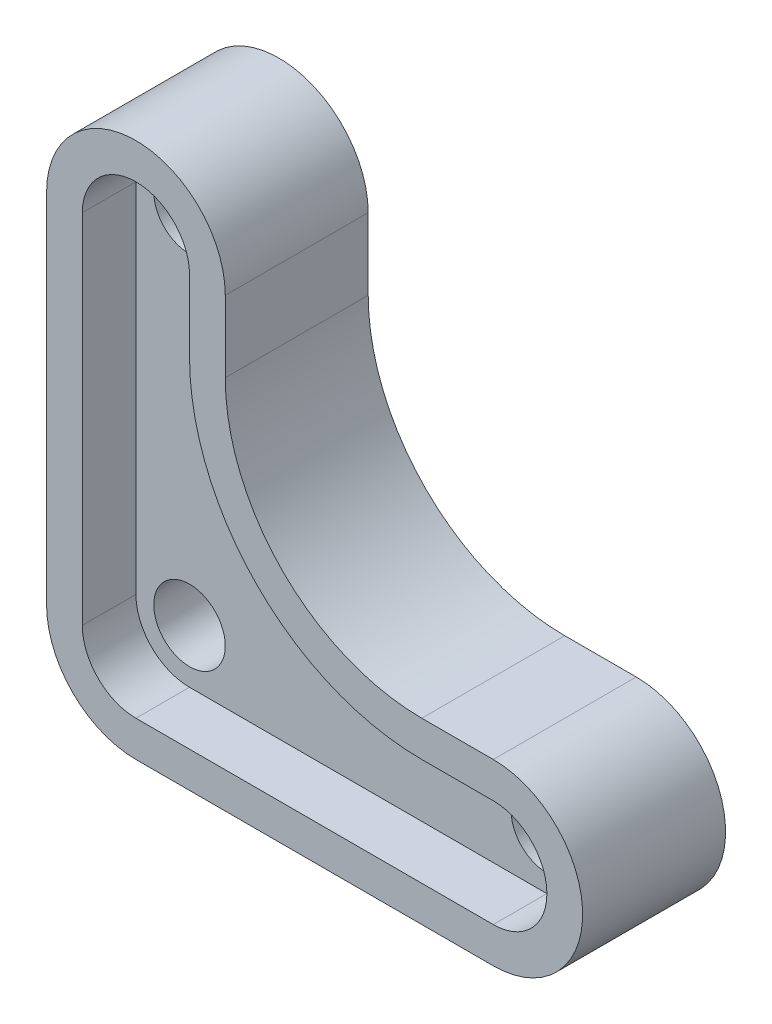
ISO-10303-21;
HEADER;
FILE_DESCRIPTION(('STEP AP214'),'2;1');
FILE_NAME('part.step','',(''),(''),'','','');
FILE_SCHEMA(('AUTOMOTIVE_DESIGN { 1 0 10303 214 1 1 1 1 }'));
ENDSEC;
DATA;
#1=APPLICATION_CONTEXT('core data for automotive mechanical design processes');
#2=APPLICATION_PROTOCOL_DEFINITION('international standard','automotive_design',2000,#1);
#3=PRODUCT_CONTEXT('',#1,'mechanical');
#4=PRODUCT('Part','Part','',(#3));
#5=PRODUCT_RELATED_PRODUCT_CATEGORY('part','',(#4));
#6=PRODUCT_DEFINITION_FORMATION('','',#4);
#7=PRODUCT_DEFINITION_CONTEXT('part definition',#1,'design');
#8=PRODUCT_DEFINITION('design','',#6,#7);
#9=PRODUCT_DEFINITION_SHAPE('','',#8);
#10=(LENGTH_UNIT() NAMED_UNIT(*) SI_UNIT(.MILLI.,.METRE.));
#11=(NAMED_UNIT(*) PLANE_ANGLE_UNIT() SI_UNIT($,.RADIAN.));
#12=(NAMED_UNIT(*) SI_UNIT($,.STERADIAN.) SOLID_ANGLE_UNIT());
#13=UNCERTAINTY_MEASURE_WITH_UNIT(LENGTH_MEASURE(1.E-05),#10,'distance_accuracy_value','');
#14=(GEOMETRIC_REPRESENTATION_CONTEXT(3) GLOBAL_UNCERTAINTY_ASSIGNED_CONTEXT((#13)) GLOBAL_UNIT_ASSIGNED_CONTEXT((#10,
#11,#12)) REPRESENTATION_CONTEXT('',''));
#15=CARTESIAN_POINT('',(0.,0.,0.));
#16=DIRECTION('',(0.,0.,1.));
#17=DIRECTION('',(1.,0.,0.));
#18=AXIS2_PLACEMENT_3D('',#15,#16,#17);
#19=CARTESIAN_POINT('',(0.,5.,5.));
#20=DIRECTION('',(0.,1.,0.));
#21=DIRECTION('',(-1.,0.,0.));
#22=AXIS2_PLACEMENT_3D('',#19,#20,#21);
#23=PLANE('',#22);
#24=DIRECTION('',(-1.,0.,0.));
#25=VECTOR('',#24,1.);
#26=CARTESIAN_POINT('',(0.,5.,5.));
#27=LINE('',#26,#25);
#28=CARTESIAN_POINT('',(0.,5.,5.));
#29=VERTEX_POINT('',#28);
#30=CARTESIAN_POINT('',(-3.99999999999999,5.,5.));
#31=VERTEX_POINT('',#30);
#32=EDGE_CURVE('E210',#29,#31,#27,.T.);
#33=ORIENTED_EDGE('',*,*,#32,.T.);
#34=DIRECTION('',(0.,0.,1.));
#35=VECTOR('',#34,1.);
#36=CARTESIAN_POINT('',(-3.99999999999999,5.,13.));
#37=LINE('',#36,#35);
#38=CARTESIAN_POINT('',(-3.99999999999999,5.,13.));
#39=VERTEX_POINT('',#38);
#40=EDGE_CURVE('E278',#31,#39,#37,.T.);
#41=ORIENTED_EDGE('',*,*,#40,.T.);
#42=DIRECTION('',(-1.,0.,0.));
#43=VECTOR('',#42,1.);
#44=CARTESIAN_POINT('',(0.,5.,13.));
#45=LINE('',#44,#43);
#46=CARTESIAN_POINT('',(0.,5.,13.));
#47=VERTEX_POINT('',#46);
#48=EDGE_CURVE('E205',#47,#39,#45,.T.);
#49=ORIENTED_EDGE('',*,*,#48,.F.);
#50=DIRECTION('',(0.,0.,1.));
#51=VECTOR('',#50,1.);
#52=CARTESIAN_POINT('',(0.,5.,5.));
#53=LINE('',#52,#51);
#54=EDGE_CURVE('E242',#29,#47,#53,.T.);
#55=ORIENTED_EDGE('',*,*,#54,.F.);
#56=EDGE_LOOP('',(#33,#41,#49,#55));
#57=FACE_BOUND('',#56,.T.);
#58=ADVANCED_FACE('F39',(#57),#23,.T.);
#59=CARTESIAN_POINT('',(0.,0.,5.));
#60=DIRECTION('',(0.,0.,1.));
#61=DIRECTION('',(1.,0.,0.));
#62=AXIS2_PLACEMENT_3D('',#59,#60,#61);
#63=CYLINDRICAL_SURFACE('',#62,5.);
#64=CARTESIAN_POINT('',(0.,0.,13.));
#65=DIRECTION('',(0.,0.,1.));
#66=DIRECTION('',(1.,0.,0.));
#67=AXIS2_PLACEMENT_3D('',#64,#65,#66);
#68=CIRCLE('',#67,5.);
#69=CARTESIAN_POINT('',(0.,-5.,13.));
#70=VERTEX_POINT('',#69);
#71=EDGE_CURVE('E214',#70,#47,#68,.T.);
#72=ORIENTED_EDGE('',*,*,#71,.F.);
#73=DIRECTION('',(0.,0.,1.));
#74=VECTOR('',#73,1.);
#75=CARTESIAN_POINT('',(0.,-5.,5.));
#76=LINE('',#75,#74);
#77=CARTESIAN_POINT('',(0.,-5.,5.));
#78=VERTEX_POINT('',#77);
#79=EDGE_CURVE('E245',#78,#70,#76,.T.);
#80=ORIENTED_EDGE('',*,*,#79,.F.);
#81=CARTESIAN_POINT('',(0.,0.,5.));
#82=DIRECTION('',(0.,0.,1.));
#83=DIRECTION('',(1.,0.,0.));
#84=AXIS2_PLACEMENT_3D('',#81,#82,#83);
#85=CIRCLE('',#84,5.);
#86=EDGE_CURVE('E224',#78,#29,#85,.T.);
#87=ORIENTED_EDGE('',*,*,#86,.T.);
#88=ORIENTED_EDGE('',*,*,#54,.T.);
#89=EDGE_LOOP('',(#72,#80,#87,#88));
#90=FACE_BOUND('',#89,.T.);
#91=ADVANCED_FACE('F318',(#90),#63,.T.);
#92=CARTESIAN_POINT('',(-25.,-5.,5.));
#93=DIRECTION('',(0.,-1.,0.));
#94=DIRECTION('',(1.,0.,0.));
#95=AXIS2_PLACEMENT_3D('',#92,#93,#94);
#96=PLANE('',#95);
#97=DIRECTION('',(1.,0.,0.));
#98=VECTOR('',#97,1.);
#99=CARTESIAN_POINT('',(-25.,-5.,13.));
#100=LINE('',#99,#98);
#101=CARTESIAN_POINT('',(-20.,-5.,13.));
#102=VERTEX_POINT('',#101);
#103=EDGE_CURVE('E238',#102,#70,#100,.T.);
#104=ORIENTED_EDGE('',*,*,#103,.F.);
#105=DIRECTION('',(0.,0.,1.));
#106=VECTOR('',#105,1.);
#107=CARTESIAN_POINT('',(-20.,-5.,5.));
#108=LINE('',#107,#106);
#109=CARTESIAN_POINT('',(-20.,-5.,5.));
#110=VERTEX_POINT('',#109);
#111=EDGE_CURVE('E274',#102,#110,#108,.F.);
#112=ORIENTED_EDGE('',*,*,#111,.T.);
#113=DIRECTION('',(1.,0.,0.));
#114=VECTOR('',#113,1.);
#115=CARTESIAN_POINT('',(-25.,-5.,5.));
#116=LINE('',#115,#114);
#117=EDGE_CURVE('E222',#110,#78,#116,.T.);
#118=ORIENTED_EDGE('',*,*,#117,.T.);
#119=ORIENTED_EDGE('',*,*,#79,.T.);
#120=EDGE_LOOP('',(#104,#112,#118,#119));
#121=FACE_BOUND('',#120,.T.);
#122=ADVANCED_FACE('F326',(#121),#96,.T.);
#123=CARTESIAN_POINT('',(-25.,20.,5.));
#124=DIRECTION('',(-1.,0.,0.));
#125=DIRECTION('',(0.,-1.,0.));
#126=AXIS2_PLACEMENT_3D('',#123,#124,#125);
#127=PLANE('',#126);
#128=DIRECTION('',(0.,-1.,0.));
#129=VECTOR('',#128,1.);
#130=CARTESIAN_POINT('',(-25.,20.,5.));
#131=LINE('',#130,#129);
#132=CARTESIAN_POINT('',(-25.,20.,5.));
#133=VERTEX_POINT('',#132);
#134=CARTESIAN_POINT('',(-25.,0.,5.));
#135=VERTEX_POINT('',#134);
#136=EDGE_CURVE('E219',#133,#135,#131,.T.);
#137=ORIENTED_EDGE('',*,*,#136,.T.);
#138=DIRECTION('',(0.,0.,1.));
#139=VECTOR('',#138,1.);
#140=CARTESIAN_POINT('',(-25.,0.,5.));
#141=LINE('',#140,#139);
#142=CARTESIAN_POINT('',(-25.,0.,13.));
#143=VERTEX_POINT('',#142);
#144=EDGE_CURVE('E269',#135,#143,#141,.T.);
#145=ORIENTED_EDGE('',*,*,#144,.T.);
#146=DIRECTION('',(0.,-1.,0.));
#147=VECTOR('',#146,1.);
#148=CARTESIAN_POINT('',(-25.,20.,13.));
#149=LINE('',#148,#147);
#150=CARTESIAN_POINT('',(-25.,20.,13.));
#151=VERTEX_POINT('',#150);
#152=EDGE_CURVE('E235',#151,#143,#149,.T.);
#153=ORIENTED_EDGE('',*,*,#152,.F.);
#154=DIRECTION('',(0.,0.,1.));
#155=VECTOR('',#154,1.);
#156=CARTESIAN_POINT('',(-25.,20.,5.));
#157=LINE('',#156,#155);
#158=EDGE_CURVE('E248',#133,#151,#157,.T.);
#159=ORIENTED_EDGE('',*,*,#158,.F.);
#160=EDGE_LOOP('',(#137,#145,#153,#159));
#161=FACE_BOUND('',#160,.T.);
#162=ADVANCED_FACE('F350',(#161),#127,.T.);
#163=CARTESIAN_POINT('',(-20.,20.,5.));
#164=DIRECTION('',(0.,0.,1.));
#165=DIRECTION('',(1.,0.,0.));
#166=AXIS2_PLACEMENT_3D('',#163,#164,#165);
#167=CYLINDRICAL_SURFACE('',#166,5.);
#168=CARTESIAN_POINT('',(-20.,20.,13.));
#169=DIRECTION('',(0.,0.,1.));
#170=DIRECTION('',(1.,0.,0.));
#171=AXIS2_PLACEMENT_3D('',#168,#169,#170);
#172=CIRCLE('',#171,5.);
#173=CARTESIAN_POINT('',(-15.,20.,13.));
#174=VERTEX_POINT('',#173);
#175=EDGE_CURVE('E232',#174,#151,#172,.T.);
#176=ORIENTED_EDGE('',*,*,#175,.F.);
#177=DIRECTION('',(0.,0.,1.));
#178=VECTOR('',#177,1.);
#179=CARTESIAN_POINT('',(-15.,20.,5.));
#180=LINE('',#179,#178);
#181=CARTESIAN_POINT('',(-15.,20.,5.));
#182=VERTEX_POINT('',#181);
#183=EDGE_CURVE('E227',#182,#174,#180,.T.);
#184=ORIENTED_EDGE('',*,*,#183,.F.);
#185=CARTESIAN_POINT('',(-20.,20.,5.));
#186=DIRECTION('',(0.,0.,1.));
#187=DIRECTION('',(1.,0.,0.));
#188=AXIS2_PLACEMENT_3D('',#185,#186,#187);
#189=CIRCLE('',#188,5.);
#190=EDGE_CURVE('E216',#182,#133,#189,.T.);
#191=ORIENTED_EDGE('',*,*,#190,.T.);
#192=ORIENTED_EDGE('',*,*,#158,.T.);
#193=EDGE_LOOP('',(#176,#184,#191,#192));
#194=FACE_BOUND('',#193,.T.);
#195=ADVANCED_FACE('F354',(#194),#167,.T.);
#196=CARTESIAN_POINT('',(-15.,5.,5.));
#197=DIRECTION('',(1.,0.,0.));
#198=DIRECTION('',(0.,1.,0.));
#199=AXIS2_PLACEMENT_3D('',#196,#197,#198);
#200=PLANE('',#199);
#201=DIRECTION('',(0.,1.,0.));
#202=VECTOR('',#201,1.);
#203=CARTESIAN_POINT('',(-15.,5.,13.));
#204=LINE('',#203,#202);
#205=CARTESIAN_POINT('',(-15.,16.,13.));
#206=VERTEX_POINT('',#205);
#207=EDGE_CURVE('E230',#206,#174,#204,.T.);
#208=ORIENTED_EDGE('',*,*,#207,.F.);
#209=DIRECTION('',(0.,0.,1.));
#210=VECTOR('',#209,1.);
#211=CARTESIAN_POINT('',(-15.,16.,5.));
#212=LINE('',#211,#210);
#213=CARTESIAN_POINT('',(-15.,16.,5.));
#214=VERTEX_POINT('',#213);
#215=EDGE_CURVE('E281',#206,#214,#212,.F.);
#216=ORIENTED_EDGE('',*,*,#215,.T.);
#217=DIRECTION('',(0.,1.,0.));
#218=VECTOR('',#217,1.);
#219=CARTESIAN_POINT('',(-15.,5.,5.));
#220=LINE('',#219,#218);
#221=EDGE_CURVE('E213',#214,#182,#220,.T.);
#222=ORIENTED_EDGE('',*,*,#221,.T.);
#223=ORIENTED_EDGE('',*,*,#183,.T.);
#224=EDGE_LOOP('',(#208,#216,#222,#223));
#225=FACE_BOUND('',#224,.T.);
#226=ADVANCED_FACE('F331',(#225),#200,.T.);
#227=CARTESIAN_POINT('',(-20.,20.,5.));
#228=DIRECTION('',(0.,0.,1.));
#229=DIRECTION('',(1.,0.,0.));
#230=AXIS2_PLACEMENT_3D('',#227,#228,#229);
#231=PLANE('',#230);
#232=CARTESIAN_POINT('',(-20.,20.,5.));
#233=DIRECTION('',(0.,0.,-1.));
#234=DIRECTION('',(-1.,0.,0.));
#235=AXIS2_PLACEMENT_3D('',#232,#233,#234);
#236=CIRCLE('',#235,1.99999999999998);
#237=CARTESIAN_POINT('',(-22.,20.,5.));
#238=VERTEX_POINT('',#237);
#239=EDGE_CURVE('E261',#238,#238,#236,.T.);
#240=ORIENTED_EDGE('',*,*,#239,.F.);
#241=EDGE_LOOP('',(#240));
#242=FACE_BOUND('',#241,.T.);
#243=CARTESIAN_POINT('',(-20.,0.,5.));
#244=DIRECTION('',(0.,0.,-1.));
#245=DIRECTION('',(-1.,0.,0.));
#246=AXIS2_PLACEMENT_3D('',#243,#244,#245);
#247=CIRCLE('',#246,1.99999999999998);
#248=CARTESIAN_POINT('',(-22.,0.,5.));
#249=VERTEX_POINT('',#248);
#250=EDGE_CURVE('E257',#249,#249,#247,.T.);
#251=ORIENTED_EDGE('',*,*,#250,.F.);
#252=EDGE_LOOP('',(#251));
#253=FACE_BOUND('',#252,.T.);
#254=CARTESIAN_POINT('',(0.,0.,5.));
#255=DIRECTION('',(0.,0.,-1.));
#256=DIRECTION('',(-1.,0.,0.));
#257=AXIS2_PLACEMENT_3D('',#254,#255,#256);
#258=CIRCLE('',#257,1.99999999999999);
#259=CARTESIAN_POINT('',(-1.99999999999999,0.,5.));
#260=VERTEX_POINT('',#259);
#261=EDGE_CURVE('E183',#260,#260,#258,.T.);
#262=ORIENTED_EDGE('',*,*,#261,.F.);
#263=EDGE_LOOP('',(#262));
#264=FACE_BOUND('',#263,.T.);
#265=ORIENTED_EDGE('',*,*,#117,.F.);
#266=CARTESIAN_POINT('',(-20.,0.,5.));
#267=DIRECTION('',(0.,0.,1.));
#268=DIRECTION('',(1.,0.,0.));
#269=AXIS2_PLACEMENT_3D('',#266,#267,#268);
#270=CIRCLE('',#269,5.);
#271=EDGE_CURVE('E276',#110,#135,#270,.F.);
#272=ORIENTED_EDGE('',*,*,#271,.T.);
#273=ORIENTED_EDGE('',*,*,#136,.F.);
#274=ORIENTED_EDGE('',*,*,#190,.F.);
#275=ORIENTED_EDGE('',*,*,#221,.F.);
#276=CARTESIAN_POINT('',(-3.99999999999999,16.,5.));
#277=DIRECTION('',(0.,0.,1.));
#278=DIRECTION('',(1.,0.,0.));
#279=AXIS2_PLACEMENT_3D('',#276,#277,#278);
#280=CIRCLE('',#279,11.);
#281=EDGE_CURVE('E285',#214,#31,#280,.T.);
#282=ORIENTED_EDGE('',*,*,#281,.T.);
#283=ORIENTED_EDGE('',*,*,#32,.F.);
#284=ORIENTED_EDGE('',*,*,#86,.F.);
#285=EDGE_LOOP('',(#265,#272,#273,#274,#275,#282,#283,#284));
#286=FACE_BOUND('',#285,.T.);
#287=ADVANCED_FACE('F346',(#242,#253,#264,#286),#231,.F.);
#288=CARTESIAN_POINT('',(-20.,20.,13.));
#289=DIRECTION('',(0.,0.,1.));
#290=DIRECTION('',(1.,0.,0.));
#291=AXIS2_PLACEMENT_3D('',#288,#289,#290);
#292=PLANE('',#291);
#293=DIRECTION('',(0.,1.,0.));
#294=VECTOR('',#293,1.);
#295=CARTESIAN_POINT('',(-17.,3.,13.));
#296=LINE('',#295,#294);
#297=CARTESIAN_POINT('',(-17.,16.,13.));
#298=VERTEX_POINT('',#297);
#299=CARTESIAN_POINT('',(-17.,20.,13.));
#300=VERTEX_POINT('',#299);
#301=EDGE_CURVE('E178',#298,#300,#296,.T.);
#302=ORIENTED_EDGE('',*,*,#301,.F.);
#303=CARTESIAN_POINT('',(-4.,16.,13.));
#304=DIRECTION('',(0.,0.,1.));
#305=DIRECTION('',(1.,0.,0.));
#306=AXIS2_PLACEMENT_3D('',#303,#304,#305);
#307=CIRCLE('',#306,13.);
#308=CARTESIAN_POINT('',(-4.,3.,13.));
#309=VERTEX_POINT('',#308);
#310=EDGE_CURVE('E61',#298,#309,#307,.T.);
#311=ORIENTED_EDGE('',*,*,#310,.T.);
#312=DIRECTION('',(-1.,0.,0.));
#313=VECTOR('',#312,1.);
#314=CARTESIAN_POINT('',(0.,3.,13.));
#315=LINE('',#314,#313);
#316=CARTESIAN_POINT('',(0.,3.,13.));
#317=VERTEX_POINT('',#316);
#318=EDGE_CURVE('E180',#317,#309,#315,.T.);
#319=ORIENTED_EDGE('',*,*,#318,.F.);
#320=CARTESIAN_POINT('',(0.,0.,13.));
#321=DIRECTION('',(0.,0.,1.));
#322=DIRECTION('',(1.,0.,0.));
#323=AXIS2_PLACEMENT_3D('',#320,#321,#322);
#324=CIRCLE('',#323,3.);
#325=CARTESIAN_POINT('',(0.,-3.,13.));
#326=VERTEX_POINT('',#325);
#327=EDGE_CURVE('E199',#326,#317,#324,.T.);
#328=ORIENTED_EDGE('',*,*,#327,.F.);
#329=DIRECTION('',(1.,0.,0.));
#330=VECTOR('',#329,1.);
#331=CARTESIAN_POINT('',(-23.,-3.,13.));
#332=LINE('',#331,#330);
#333=CARTESIAN_POINT('',(-20.,-3.,13.));
#334=VERTEX_POINT('',#333);
#335=EDGE_CURVE('E197',#334,#326,#332,.T.);
#336=ORIENTED_EDGE('',*,*,#335,.F.);
#337=CARTESIAN_POINT('',(-20.,0.,13.));
#338=DIRECTION('',(0.,0.,1.));
#339=DIRECTION('',(1.,0.,0.));
#340=AXIS2_PLACEMENT_3D('',#337,#338,#339);
#341=CIRCLE('',#340,3.);
#342=CARTESIAN_POINT('',(-23.,0.,13.));
#343=VERTEX_POINT('',#342);
#344=EDGE_CURVE('E267',#334,#343,#341,.F.);
#345=ORIENTED_EDGE('',*,*,#344,.T.);
#346=DIRECTION('',(0.,-1.,0.));
#347=VECTOR('',#346,1.);
#348=CARTESIAN_POINT('',(-23.,20.,13.));
#349=LINE('',#348,#347);
#350=CARTESIAN_POINT('',(-23.,20.,13.));
#351=VERTEX_POINT('',#350);
#352=EDGE_CURVE('E194',#351,#343,#349,.T.);
#353=ORIENTED_EDGE('',*,*,#352,.F.);
#354=CARTESIAN_POINT('',(-20.,20.,13.));
#355=DIRECTION('',(0.,0.,1.));
#356=DIRECTION('',(1.,0.,0.));
#357=AXIS2_PLACEMENT_3D('',#354,#355,#356);
#358=CIRCLE('',#357,3.);
#359=EDGE_CURVE('E159',#300,#351,#358,.T.);
#360=ORIENTED_EDGE('',*,*,#359,.F.);
#361=EDGE_LOOP('',(#302,#311,#319,#328,#336,#345,#353,#360));
#362=FACE_BOUND('',#361,.T.);
#363=ORIENTED_EDGE('',*,*,#152,.T.);
#364=CARTESIAN_POINT('',(-20.,0.,13.));
#365=DIRECTION('',(0.,0.,1.));
#366=DIRECTION('',(1.,0.,0.));
#367=AXIS2_PLACEMENT_3D('',#364,#365,#366);
#368=CIRCLE('',#367,5.);
#369=EDGE_CURVE('E272',#143,#102,#368,.T.);
#370=ORIENTED_EDGE('',*,*,#369,.T.);
#371=ORIENTED_EDGE('',*,*,#103,.T.);
#372=ORIENTED_EDGE('',*,*,#71,.T.);
#373=ORIENTED_EDGE('',*,*,#48,.T.);
#374=CARTESIAN_POINT('',(-3.99999999999999,16.,13.));
#375=DIRECTION('',(0.,0.,1.));
#376=DIRECTION('',(1.,0.,0.));
#377=AXIS2_PLACEMENT_3D('',#374,#375,#376);
#378=CIRCLE('',#377,11.);
#379=EDGE_CURVE('E283',#39,#206,#378,.F.);
#380=ORIENTED_EDGE('',*,*,#379,.T.);
#381=ORIENTED_EDGE('',*,*,#207,.T.);
#382=ORIENTED_EDGE('',*,*,#175,.T.);
#383=EDGE_LOOP('',(#363,#370,#371,#372,#373,#380,#381,#382));
#384=FACE_BOUND('',#383,.T.);
#385=ADVANCED_FACE('F295',(#362,#384),#292,.T.);
#386=CARTESIAN_POINT('',(-20.,20.,10.));
#387=DIRECTION('',(0.,0.,1.));
#388=DIRECTION('',(1.,0.,0.));
#389=AXIS2_PLACEMENT_3D('',#386,#387,#388);
#390=CYLINDRICAL_SURFACE('',#389,3.);
#391=ORIENTED_EDGE('',*,*,#359,.T.);
#392=DIRECTION('',(0.,0.,1.));
#393=VECTOR('',#392,1.);
#394=CARTESIAN_POINT('',(-23.,20.,10.));
#395=LINE('',#394,#393);
#396=CARTESIAN_POINT('',(-23.,20.,10.));
#397=VERTEX_POINT('',#396);
#398=EDGE_CURVE('E152',#397,#351,#395,.T.);
#399=ORIENTED_EDGE('',*,*,#398,.F.);
#400=CARTESIAN_POINT('',(-20.,20.,10.));
#401=DIRECTION('',(0.,0.,1.));
#402=DIRECTION('',(1.,0.,0.));
#403=AXIS2_PLACEMENT_3D('',#400,#401,#402);
#404=CIRCLE('',#403,3.);
#405=CARTESIAN_POINT('',(-17.,20.,10.));
#406=VERTEX_POINT('',#405);
#407=EDGE_CURVE('E157',#406,#397,#404,.T.);
#408=ORIENTED_EDGE('',*,*,#407,.F.);
#409=DIRECTION('',(0.,0.,1.));
#410=VECTOR('',#409,1.);
#411=CARTESIAN_POINT('',(-17.,20.,10.));
#412=LINE('',#411,#410);
#413=EDGE_CURVE('E203',#406,#300,#412,.T.);
#414=ORIENTED_EDGE('',*,*,#413,.T.);
#415=EDGE_LOOP('',(#391,#399,#408,#414));
#416=FACE_BOUND('',#415,.T.);
#417=ADVANCED_FACE('F154',(#416),#390,.F.);
#418=CARTESIAN_POINT('',(-17.,3.,10.));
#419=DIRECTION('',(1.,0.,0.));
#420=DIRECTION('',(0.,0.,-1.));
#421=AXIS2_PLACEMENT_3D('',#418,#419,#420);
#422=PLANE('',#421);
#423=DIRECTION('',(0.,1.,0.));
#424=VECTOR('',#423,1.);
#425=CARTESIAN_POINT('',(-17.,3.,10.));
#426=LINE('',#425,#424);
#427=CARTESIAN_POINT('',(-17.,16.,10.));
#428=VERTEX_POINT('',#427);
#429=EDGE_CURVE('E164',#428,#406,#426,.T.);
#430=ORIENTED_EDGE('',*,*,#429,.F.);
#431=DIRECTION('',(0.,0.,1.));
#432=VECTOR('',#431,1.);
#433=CARTESIAN_POINT('',(-17.,16.,10.));
#434=LINE('',#433,#432);
#435=EDGE_CURVE('E287',#428,#298,#434,.T.);
#436=ORIENTED_EDGE('',*,*,#435,.T.);
#437=ORIENTED_EDGE('',*,*,#301,.T.);
#438=ORIENTED_EDGE('',*,*,#413,.F.);
#439=EDGE_LOOP('',(#430,#436,#437,#438));
#440=FACE_BOUND('',#439,.T.);
#441=ADVANCED_FACE('F292',(#440),#422,.F.);
#442=CARTESIAN_POINT('',(0.,3.,10.));
#443=DIRECTION('',(0.,1.,0.));
#444=DIRECTION('',(-1.,0.,0.));
#445=AXIS2_PLACEMENT_3D('',#442,#443,#444);
#446=PLANE('',#445);
#447=ORIENTED_EDGE('',*,*,#318,.T.);
#448=DIRECTION('',(0.,0.,1.));
#449=VECTOR('',#448,1.);
#450=CARTESIAN_POINT('',(-4.,3.,10.));
#451=LINE('',#450,#449);
#452=CARTESIAN_POINT('',(-4.,3.,10.));
#453=VERTEX_POINT('',#452);
#454=EDGE_CURVE('E47',#309,#453,#451,.F.);
#455=ORIENTED_EDGE('',*,*,#454,.T.);
#456=DIRECTION('',(-1.,0.,0.));
#457=VECTOR('',#456,1.);
#458=CARTESIAN_POINT('',(0.,3.,10.));
#459=LINE('',#458,#457);
#460=CARTESIAN_POINT('',(0.,3.,10.));
#461=VERTEX_POINT('',#460);
#462=EDGE_CURVE('E190',#461,#453,#459,.T.);
#463=ORIENTED_EDGE('',*,*,#462,.F.);
#464=DIRECTION('',(0.,0.,1.));
#465=VECTOR('',#464,1.);
#466=CARTESIAN_POINT('',(0.,3.,10.));
#467=LINE('',#466,#465);
#468=EDGE_CURVE('E206',#461,#317,#467,.T.);
#469=ORIENTED_EDGE('',*,*,#468,.T.);
#470=EDGE_LOOP('',(#447,#455,#463,#469));
#471=FACE_BOUND('',#470,.T.);
#472=ADVANCED_FACE('F396',(#471),#446,.F.);
#473=CARTESIAN_POINT('',(0.,0.,10.));
#474=DIRECTION('',(0.,0.,1.));
#475=DIRECTION('',(1.,0.,0.));
#476=AXIS2_PLACEMENT_3D('',#473,#474,#475);
#477=CYLINDRICAL_SURFACE('',#476,3.);
#478=ORIENTED_EDGE('',*,*,#327,.T.);
#479=ORIENTED_EDGE('',*,*,#468,.F.);
#480=CARTESIAN_POINT('',(0.,0.,10.));
#481=DIRECTION('',(0.,0.,1.));
#482=DIRECTION('',(1.,0.,0.));
#483=AXIS2_PLACEMENT_3D('',#480,#481,#482);
#484=CIRCLE('',#483,3.);
#485=CARTESIAN_POINT('',(0.,-3.,10.));
#486=VERTEX_POINT('',#485);
#487=EDGE_CURVE('E187',#486,#461,#484,.T.);
#488=ORIENTED_EDGE('',*,*,#487,.F.);
#489=DIRECTION('',(0.,0.,1.));
#490=VECTOR('',#489,1.);
#491=CARTESIAN_POINT('',(0.,-3.,10.));
#492=LINE('',#491,#490);
#493=EDGE_CURVE('E163',#486,#326,#492,.T.);
#494=ORIENTED_EDGE('',*,*,#493,.T.);
#495=EDGE_LOOP('',(#478,#479,#488,#494));
#496=FACE_BOUND('',#495,.T.);
#497=ADVANCED_FACE('F308',(#496),#477,.F.);
#498=CARTESIAN_POINT('',(-23.,-3.,10.));
#499=DIRECTION('',(0.,-1.,0.));
#500=DIRECTION('',(0.,0.,-1.));
#501=AXIS2_PLACEMENT_3D('',#498,#499,#500);
#502=PLANE('',#501);
#503=DIRECTION('',(1.,0.,0.));
#504=VECTOR('',#503,1.);
#505=CARTESIAN_POINT('',(-23.,-3.,10.));
#506=LINE('',#505,#504);
#507=CARTESIAN_POINT('',(-20.,-3.,10.));
#508=VERTEX_POINT('',#507);
#509=EDGE_CURVE('E173',#508,#486,#506,.T.);
#510=ORIENTED_EDGE('',*,*,#509,.F.);
#511=DIRECTION('',(0.,0.,1.));
#512=VECTOR('',#511,1.);
#513=CARTESIAN_POINT('',(-20.,-3.,13.));
#514=LINE('',#513,#512);
#515=EDGE_CURVE('E244',#508,#334,#514,.T.);
#516=ORIENTED_EDGE('',*,*,#515,.T.);
#517=ORIENTED_EDGE('',*,*,#335,.T.);
#518=ORIENTED_EDGE('',*,*,#493,.F.);
#519=EDGE_LOOP('',(#510,#516,#517,#518));
#520=FACE_BOUND('',#519,.T.);
#521=ADVANCED_FACE('F304',(#520),#502,.F.);
#522=CARTESIAN_POINT('',(-23.,20.,10.));
#523=DIRECTION('',(-1.,0.,0.));
#524=DIRECTION('',(0.,0.,1.));
#525=AXIS2_PLACEMENT_3D('',#522,#523,#524);
#526=PLANE('',#525);
#527=ORIENTED_EDGE('',*,*,#352,.T.);
#528=DIRECTION('',(0.,0.,1.));
#529=VECTOR('',#528,1.);
#530=CARTESIAN_POINT('',(-23.,0.,10.));
#531=LINE('',#530,#529);
#532=CARTESIAN_POINT('',(-23.,0.,10.));
#533=VERTEX_POINT('',#532);
#534=EDGE_CURVE('E170',#343,#533,#531,.F.);
#535=ORIENTED_EDGE('',*,*,#534,.T.);
#536=DIRECTION('',(0.,-1.,0.));
#537=VECTOR('',#536,1.);
#538=CARTESIAN_POINT('',(-23.,20.,10.));
#539=LINE('',#538,#537);
#540=EDGE_CURVE('E167',#397,#533,#539,.T.);
#541=ORIENTED_EDGE('',*,*,#540,.F.);
#542=ORIENTED_EDGE('',*,*,#398,.T.);
#543=EDGE_LOOP('',(#527,#535,#541,#542));
#544=FACE_BOUND('',#543,.T.);
#545=ADVANCED_FACE('F168',(#544),#526,.F.);
#546=CARTESIAN_POINT('',(-20.,20.,10.));
#547=DIRECTION('',(0.,0.,1.));
#548=DIRECTION('',(1.,0.,0.));
#549=AXIS2_PLACEMENT_3D('',#546,#547,#548);
#550=PLANE('',#549);
#551=CARTESIAN_POINT('',(-20.,20.,10.));
#552=DIRECTION('',(0.,0.,1.));
#553=DIRECTION('',(1.,0.,0.));
#554=AXIS2_PLACEMENT_3D('',#551,#552,#553);
#555=CIRCLE('',#554,1.99999999999998);
#556=CARTESIAN_POINT('',(-18.,20.,10.));
#557=VERTEX_POINT('',#556);
#558=EDGE_CURVE('E258',#557,#557,#555,.T.);
#559=ORIENTED_EDGE('',*,*,#558,.F.);
#560=EDGE_LOOP('',(#559));
#561=FACE_BOUND('',#560,.T.);
#562=CARTESIAN_POINT('',(-20.,0.,10.));
#563=DIRECTION('',(0.,0.,1.));
#564=DIRECTION('',(1.,0.,0.));
#565=AXIS2_PLACEMENT_3D('',#562,#563,#564);
#566=CIRCLE('',#565,1.99999999999998);
#567=CARTESIAN_POINT('',(-18.,0.,10.));
#568=VERTEX_POINT('',#567);
#569=EDGE_CURVE('E254',#568,#568,#566,.T.);
#570=ORIENTED_EDGE('',*,*,#569,.F.);
#571=EDGE_LOOP('',(#570));
#572=FACE_BOUND('',#571,.T.);
#573=CARTESIAN_POINT('',(0.,0.,10.));
#574=DIRECTION('',(0.,0.,1.));
#575=DIRECTION('',(1.,0.,0.));
#576=AXIS2_PLACEMENT_3D('',#573,#574,#575);
#577=CIRCLE('',#576,1.99999999999999);
#578=CARTESIAN_POINT('',(1.99999999999999,0.,10.));
#579=VERTEX_POINT('',#578);
#580=EDGE_CURVE('E195',#579,#579,#577,.T.);
#581=ORIENTED_EDGE('',*,*,#580,.F.);
#582=EDGE_LOOP('',(#581));
#583=FACE_BOUND('',#582,.T.);
#584=ORIENTED_EDGE('',*,*,#540,.T.);
#585=CARTESIAN_POINT('',(-20.,0.,10.));
#586=DIRECTION('',(0.,0.,1.));
#587=DIRECTION('',(1.,0.,0.));
#588=AXIS2_PLACEMENT_3D('',#585,#586,#587);
#589=CIRCLE('',#588,3.);
#590=EDGE_CURVE('E265',#533,#508,#589,.T.);
#591=ORIENTED_EDGE('',*,*,#590,.T.);
#592=ORIENTED_EDGE('',*,*,#509,.T.);
#593=ORIENTED_EDGE('',*,*,#487,.T.);
#594=ORIENTED_EDGE('',*,*,#462,.T.);
#595=CARTESIAN_POINT('',(-4.,16.,10.));
#596=DIRECTION('',(0.,0.,1.));
#597=DIRECTION('',(1.,0.,0.));
#598=AXIS2_PLACEMENT_3D('',#595,#596,#597);
#599=CIRCLE('',#598,13.);
#600=EDGE_CURVE('E11',#453,#428,#599,.F.);
#601=ORIENTED_EDGE('',*,*,#600,.T.);
#602=ORIENTED_EDGE('',*,*,#429,.T.);
#603=ORIENTED_EDGE('',*,*,#407,.T.);
#604=EDGE_LOOP('',(#584,#591,#592,#593,#594,#601,#602,#603));
#605=FACE_BOUND('',#604,.T.);
#606=ADVANCED_FACE('F175',(#561,#572,#583,#605),#550,.T.);
#607=CARTESIAN_POINT('',(0.,0.,5.));
#608=DIRECTION('',(0.,0.,-1.));
#609=DIRECTION('',(-1.,0.,0.));
#610=AXIS2_PLACEMENT_3D('',#607,#608,#609);
#611=CYLINDRICAL_SURFACE('',#610,1.99999999999999);
#612=ORIENTED_EDGE('',*,*,#580,.T.);
#613=EDGE_LOOP('',(#612));
#614=FACE_BOUND('',#613,.T.);
#615=ORIENTED_EDGE('',*,*,#261,.T.);
#616=EDGE_LOOP('',(#615));
#617=FACE_BOUND('',#616,.T.);
#618=ADVANCED_FACE('F402',(#614,#617),#611,.F.);
#619=CARTESIAN_POINT('',(-20.,0.,5.));
#620=DIRECTION('',(0.,0.,-1.));
#621=DIRECTION('',(-1.,0.,0.));
#622=AXIS2_PLACEMENT_3D('',#619,#620,#621);
#623=CYLINDRICAL_SURFACE('',#622,1.99999999999998);
#624=ORIENTED_EDGE('',*,*,#569,.T.);
#625=EDGE_LOOP('',(#624));
#626=FACE_BOUND('',#625,.T.);
#627=ORIENTED_EDGE('',*,*,#250,.T.);
#628=EDGE_LOOP('',(#627));
#629=FACE_BOUND('',#628,.T.);
#630=ADVANCED_FACE('F406',(#626,#629),#623,.F.);
#631=CARTESIAN_POINT('',(-20.,20.,5.));
#632=DIRECTION('',(0.,0.,-1.));
#633=DIRECTION('',(-1.,0.,0.));
#634=AXIS2_PLACEMENT_3D('',#631,#632,#633);
#635=CYLINDRICAL_SURFACE('',#634,1.99999999999998);
#636=ORIENTED_EDGE('',*,*,#558,.T.);
#637=EDGE_LOOP('',(#636));
#638=FACE_BOUND('',#637,.T.);
#639=ORIENTED_EDGE('',*,*,#239,.T.);
#640=EDGE_LOOP('',(#639));
#641=FACE_BOUND('',#640,.T.);
#642=ADVANCED_FACE('F335',(#638,#641),#635,.F.);
#643=CARTESIAN_POINT('',(-20.,0.,10.));
#644=DIRECTION('',(0.,0.,-1.));
#645=DIRECTION('',(-1.,0.,0.));
#646=AXIS2_PLACEMENT_3D('',#643,#644,#645);
#647=CYLINDRICAL_SURFACE('',#646,3.);
#648=ORIENTED_EDGE('',*,*,#590,.F.);
#649=ORIENTED_EDGE('',*,*,#534,.F.);
#650=ORIENTED_EDGE('',*,*,#344,.F.);
#651=ORIENTED_EDGE('',*,*,#515,.F.);
#652=EDGE_LOOP('',(#648,#649,#650,#651));
#653=FACE_BOUND('',#652,.T.);
#654=ADVANCED_FACE('F299',(#653),#647,.F.);
#655=CARTESIAN_POINT('',(-20.,0.,5.));
#656=DIRECTION('',(0.,0.,1.));
#657=DIRECTION('',(1.,0.,0.));
#658=AXIS2_PLACEMENT_3D('',#655,#656,#657);
#659=CYLINDRICAL_SURFACE('',#658,5.);
#660=ORIENTED_EDGE('',*,*,#271,.F.);
#661=ORIENTED_EDGE('',*,*,#111,.F.);
#662=ORIENTED_EDGE('',*,*,#369,.F.);
#663=ORIENTED_EDGE('',*,*,#144,.F.);
#664=EDGE_LOOP('',(#660,#661,#662,#663));
#665=FACE_BOUND('',#664,.T.);
#666=ADVANCED_FACE('F315',(#665),#659,.T.);
#667=CARTESIAN_POINT('',(-3.99999999999999,16.,5.));
#668=DIRECTION('',(0.,0.,-1.));
#669=DIRECTION('',(-1.,0.,0.));
#670=AXIS2_PLACEMENT_3D('',#667,#668,#669);
#671=CYLINDRICAL_SURFACE('',#670,11.);
#672=ORIENTED_EDGE('',*,*,#281,.F.);
#673=ORIENTED_EDGE('',*,*,#215,.F.);
#674=ORIENTED_EDGE('',*,*,#379,.F.);
#675=ORIENTED_EDGE('',*,*,#40,.F.);
#676=EDGE_LOOP('',(#672,#673,#674,#675));
#677=FACE_BOUND('',#676,.T.);
#678=ADVANCED_FACE('F310',(#677),#671,.F.);
#679=CARTESIAN_POINT('',(-4.,16.,10.));
#680=DIRECTION('',(0.,0.,1.));
#681=DIRECTION('',(1.,0.,0.));
#682=AXIS2_PLACEMENT_3D('',#679,#680,#681);
#683=CYLINDRICAL_SURFACE('',#682,13.);
#684=ORIENTED_EDGE('',*,*,#600,.F.);
#685=ORIENTED_EDGE('',*,*,#454,.F.);
#686=ORIENTED_EDGE('',*,*,#310,.F.);
#687=ORIENTED_EDGE('',*,*,#435,.F.);
#688=EDGE_LOOP('',(#684,#685,#686,#687));
#689=FACE_BOUND('',#688,.T.);
#690=ADVANCED_FACE('F41',(#689),#683,.T.);
#691=CLOSED_SHELL('',(#58,#91,#122,#162,#195,#226,#287,#385,#417,#441,#472,#497,#521,#545,#606,
#618,#630,#642,#654,#666,#678,#690));
#692=MANIFOLD_SOLID_BREP('B2',#691);
#693=ADVANCED_BREP_SHAPE_REPRESENTATION('',(#18,#692),#14);
#694=SHAPE_DEFINITION_REPRESENTATION(#9,#693);
ENDSEC;
END-ISO-10303-21;
